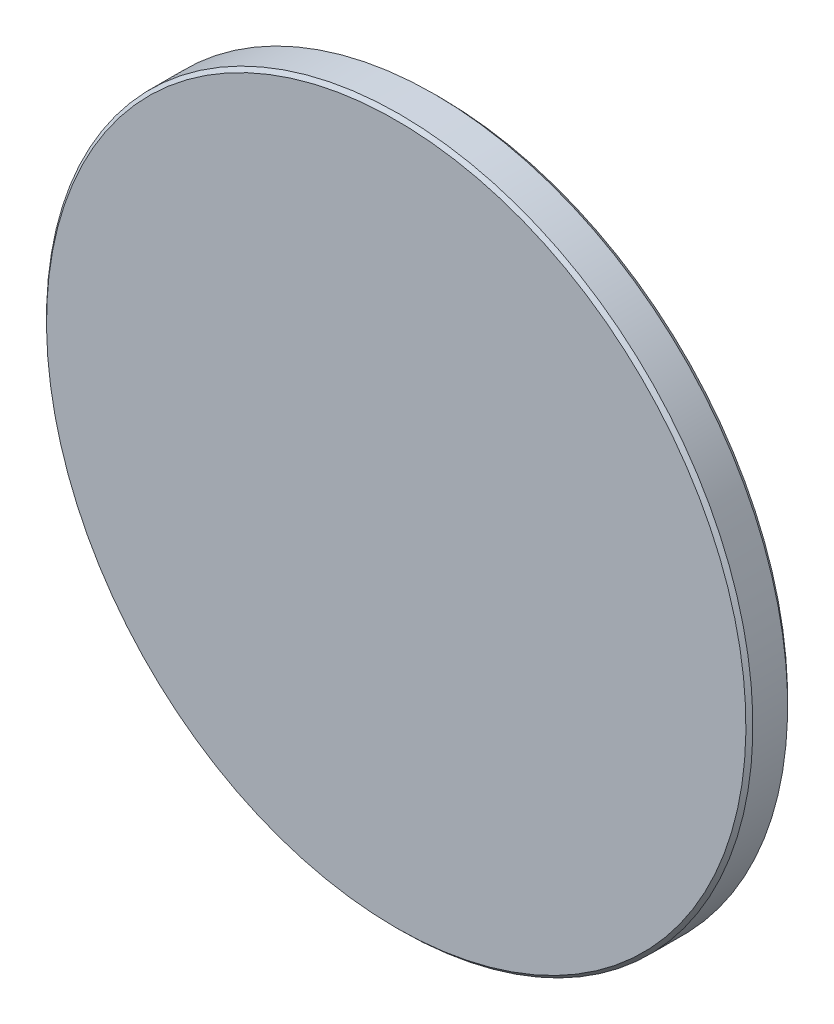
ISO-10303-21;
HEADER;
FILE_DESCRIPTION(('STEP AP214'),'2;1');
FILE_NAME('part.step','',(''),(''),'','','');
FILE_SCHEMA(('AUTOMOTIVE_DESIGN { 1 0 10303 214 1 1 1 1 }'));
ENDSEC;
DATA;
#1=APPLICATION_CONTEXT('core data for automotive mechanical design processes');
#2=APPLICATION_PROTOCOL_DEFINITION('international standard','automotive_design',2000,#1);
#3=PRODUCT_CONTEXT('',#1,'mechanical');
#4=PRODUCT('Part','Part','',(#3));
#5=PRODUCT_RELATED_PRODUCT_CATEGORY('part','',(#4));
#6=PRODUCT_DEFINITION_FORMATION('','',#4);
#7=PRODUCT_DEFINITION_CONTEXT('part definition',#1,'design');
#8=PRODUCT_DEFINITION('design','',#6,#7);
#9=PRODUCT_DEFINITION_SHAPE('','',#8);
#10=(LENGTH_UNIT() NAMED_UNIT(*) SI_UNIT(.MILLI.,.METRE.));
#11=(NAMED_UNIT(*) PLANE_ANGLE_UNIT() SI_UNIT($,.RADIAN.));
#12=(NAMED_UNIT(*) SI_UNIT($,.STERADIAN.) SOLID_ANGLE_UNIT());
#13=UNCERTAINTY_MEASURE_WITH_UNIT(LENGTH_MEASURE(1.E-05),#10,'distance_accuracy_value','');
#14=(GEOMETRIC_REPRESENTATION_CONTEXT(3) GLOBAL_UNCERTAINTY_ASSIGNED_CONTEXT((#13)) GLOBAL_UNIT_ASSIGNED_CONTEXT((#10,
#11,#12)) REPRESENTATION_CONTEXT('',''));
#15=CARTESIAN_POINT('',(0.,0.,0.));
#16=DIRECTION('',(0.,0.,1.));
#17=DIRECTION('',(1.,0.,0.));
#18=AXIS2_PLACEMENT_3D('',#15,#16,#17);
#19=CARTESIAN_POINT('',(0.,0.,56.915));
#20=DIRECTION('',(0.,0.,-1.));
#21=DIRECTION('',(0.,1.,0.));
#22=AXIS2_PLACEMENT_3D('',#19,#20,#21);
#23=SPHERICAL_SURFACE('',#22,65.075);
#24=CARTESIAN_POINT('',(0.,0.,-3.18076455462792));
#25=DIRECTION('',(0.,0.,1.));
#26=DIRECTION('',(0.,-1.,0.));
#27=AXIS2_PLACEMENT_3D('',#24,#25,#26);
#28=CIRCLE('',#27,24.9650697494464);
#29=CARTESIAN_POINT('',(0.,-24.9650697494464,-3.18076455462792));
#30=VERTEX_POINT('',#29);
#31=EDGE_CURVE('E28',#30,#30,#28,.F.);
#32=ORIENTED_EDGE('',*,*,#31,.T.);
#33=EDGE_LOOP('',(#32));
#34=FACE_BOUND('',#33,.T.);
#35=ADVANCED_FACE('F13',(#34),#23,.T.);
#36=CARTESIAN_POINT('',(0.,0.,-8.16));
#37=DIRECTION('',(0.,0.,-1.));
#38=DIRECTION('',(0.,1.,0.));
#39=AXIS2_PLACEMENT_3D('',#36,#37,#38);
#40=CYLINDRICAL_SURFACE('',#39,25.3958343040744);
#41=CARTESIAN_POINT('',(0.,0.,-2.74999999999999));
#42=DIRECTION('',(0.,0.,-1.));
#43=DIRECTION('',(0.,1.,0.));
#44=AXIS2_PLACEMENT_3D('',#41,#42,#43);
#45=CIRCLE('',#44,25.3958343040744);
#46=CARTESIAN_POINT('',(0.,25.3958343040744,-2.74999999999998));
#47=VERTEX_POINT('',#46);
#48=EDGE_CURVE('E20',#47,#47,#45,.F.);
#49=ORIENTED_EDGE('',*,*,#48,.T.);
#50=EDGE_LOOP('',(#49));
#51=FACE_BOUND('',#50,.T.);
#52=CARTESIAN_POINT('',(0.,0.,-0.249999999999999));
#53=DIRECTION('',(0.,0.,1.));
#54=DIRECTION('',(0.,-1.,0.));
#55=AXIS2_PLACEMENT_3D('',#52,#53,#54);
#56=CIRCLE('',#55,25.3958343040744);
#57=CARTESIAN_POINT('',(0.,-25.3958343040744,-0.250000000000005));
#58=VERTEX_POINT('',#57);
#59=EDGE_CURVE('E24',#58,#58,#56,.F.);
#60=ORIENTED_EDGE('',*,*,#59,.T.);
#61=EDGE_LOOP('',(#60));
#62=FACE_BOUND('',#61,.T.);
#63=ADVANCED_FACE('F45',(#51,#62),#40,.T.);
#64=CARTESIAN_POINT('',(0.,0.,0.));
#65=DIRECTION('',(0.,0.,1.));
#66=DIRECTION('',(0.,-1.,0.));
#67=AXIS2_PLACEMENT_3D('',#64,#65,#66);
#68=PLANE('',#67);
#69=CARTESIAN_POINT('',(0.,0.,0.));
#70=DIRECTION('',(0.,0.,1.));
#71=DIRECTION('',(0.,-1.,0.));
#72=AXIS2_PLACEMENT_3D('',#69,#70,#71);
#73=CIRCLE('',#72,25.1458343040744);
#74=CARTESIAN_POINT('',(0.,-25.1458343040744,0.));
#75=VERTEX_POINT('',#74);
#76=EDGE_CURVE('E9',#75,#75,#73,.T.);
#77=ORIENTED_EDGE('',*,*,#76,.T.);
#78=EDGE_LOOP('',(#77));
#79=FACE_BOUND('',#78,.T.);
#80=ADVANCED_FACE('F37',(#79),#68,.T.);
#81=CARTESIAN_POINT('',(0.,0.,-3.18076455462794));
#82=DIRECTION('',(0.,0.,1.));
#83=DIRECTION('',(0.,-1.,0.));
#84=AXIS2_PLACEMENT_3D('',#81,#82,#83);
#85=CONICAL_SURFACE('',#84,24.9650697494464,0.78539816339744);
#86=ORIENTED_EDGE('',*,*,#48,.F.);
#87=EDGE_LOOP('',(#86));
#88=FACE_BOUND('',#87,.T.);
#89=ORIENTED_EDGE('',*,*,#31,.F.);
#90=EDGE_LOOP('',(#89));
#91=FACE_BOUND('',#90,.T.);
#92=ADVANCED_FACE('F35',(#88,#91),#85,.T.);
#93=CARTESIAN_POINT('',(0.,0.,-0.249999999999999));
#94=DIRECTION('',(0.,0.,-1.));
#95=DIRECTION('',(0.,1.,0.));
#96=AXIS2_PLACEMENT_3D('',#93,#94,#95);
#97=CONICAL_SURFACE('',#96,25.3958343040744,0.785398163397455);
#98=ORIENTED_EDGE('',*,*,#76,.F.);
#99=EDGE_LOOP('',(#98));
#100=FACE_BOUND('',#99,.T.);
#101=ORIENTED_EDGE('',*,*,#59,.F.);
#102=EDGE_LOOP('',(#101));
#103=FACE_BOUND('',#102,.T.);
#104=ADVANCED_FACE('F15',(#100,#103),#97,.T.);
#105=CLOSED_SHELL('',(#35,#63,#80,#92,#104));
#106=MANIFOLD_SOLID_BREP('B1',#105);
#107=ADVANCED_BREP_SHAPE_REPRESENTATION('',(#18,#106),#14);
#108=SHAPE_DEFINITION_REPRESENTATION(#9,#107);
ENDSEC;
END-ISO-10303-21;
